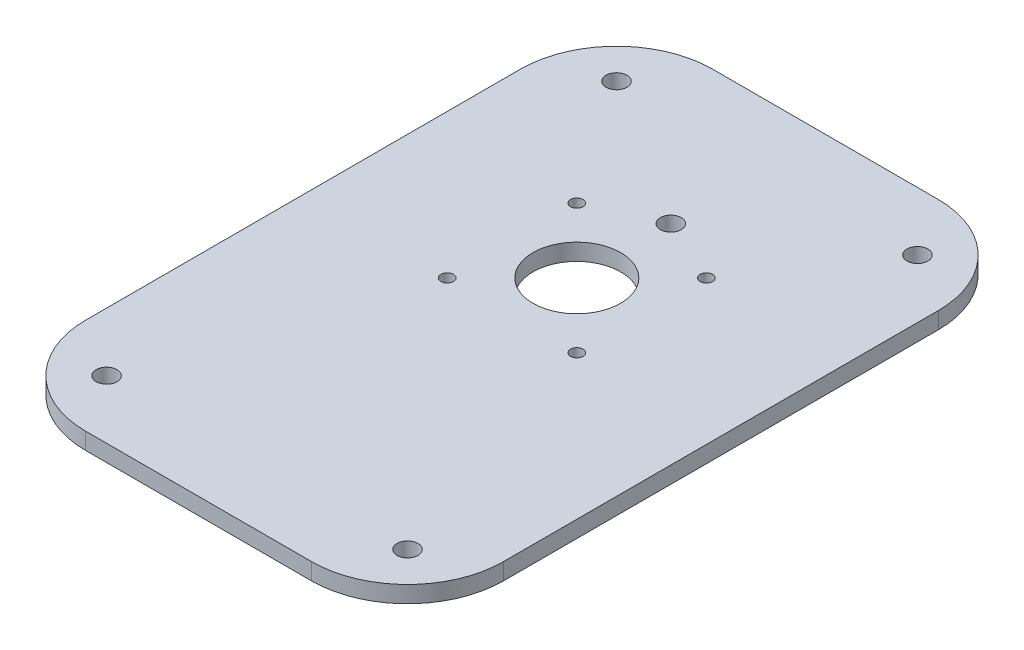
ISO-10303-21;
HEADER;
FILE_DESCRIPTION(('STEP AP214'),'2;1');
FILE_NAME('part.step','',(''),(''),'','','');
FILE_SCHEMA(('AUTOMOTIVE_DESIGN { 1 0 10303 214 1 1 1 1 }'));
ENDSEC;
DATA;
#1=APPLICATION_CONTEXT('core data for automotive mechanical design processes');
#2=APPLICATION_PROTOCOL_DEFINITION('international standard','automotive_design',2000,#1);
#3=PRODUCT_CONTEXT('',#1,'mechanical');
#4=PRODUCT('Part','Part','',(#3));
#5=PRODUCT_RELATED_PRODUCT_CATEGORY('part','',(#4));
#6=PRODUCT_DEFINITION_FORMATION('','',#4);
#7=PRODUCT_DEFINITION_CONTEXT('part definition',#1,'design');
#8=PRODUCT_DEFINITION('design','',#6,#7);
#9=PRODUCT_DEFINITION_SHAPE('','',#8);
#10=(LENGTH_UNIT() NAMED_UNIT(*) SI_UNIT(.MILLI.,.METRE.));
#11=(NAMED_UNIT(*) PLANE_ANGLE_UNIT() SI_UNIT($,.RADIAN.));
#12=(NAMED_UNIT(*) SI_UNIT($,.STERADIAN.) SOLID_ANGLE_UNIT());
#13=UNCERTAINTY_MEASURE_WITH_UNIT(LENGTH_MEASURE(1.E-05),#10,'distance_accuracy_value','');
#14=(GEOMETRIC_REPRESENTATION_CONTEXT(3) GLOBAL_UNCERTAINTY_ASSIGNED_CONTEXT((#13)) GLOBAL_UNIT_ASSIGNED_CONTEXT((#10,
#11,#12)) REPRESENTATION_CONTEXT('',''));
#15=CARTESIAN_POINT('',(0.,0.,0.));
#16=DIRECTION('',(0.,0.,1.));
#17=DIRECTION('',(1.,0.,0.));
#18=AXIS2_PLACEMENT_3D('',#15,#16,#17);
#19=CARTESIAN_POINT('',(-27.,4.,52.));
#20=DIRECTION('',(0.,-1.,0.));
#21=DIRECTION('',(0.,0.,-1.));
#22=AXIS2_PLACEMENT_3D('',#19,#20,#21);
#23=PLANE('',#22);
#24=CARTESIAN_POINT('',(-27.,4.,52.));
#25=DIRECTION('',(0.,1.,0.));
#26=DIRECTION('',(0.,0.,-1.));
#27=AXIS2_PLACEMENT_3D('',#24,#25,#26);
#28=CIRCLE('',#27,23.);
#29=CARTESIAN_POINT('',(-50.,4.,52.));
#30=VERTEX_POINT('',#29);
#31=CARTESIAN_POINT('',(-27.,4.,75.));
#32=VERTEX_POINT('',#31);
#33=EDGE_CURVE('E145',#30,#32,#28,.T.);
#34=ORIENTED_EDGE('',*,*,#33,.T.);
#35=DIRECTION('',(1.,0.,0.));
#36=VECTOR('',#35,1.);
#37=CARTESIAN_POINT('',(-27.,4.,75.));
#38=LINE('',#37,#36);
#39=CARTESIAN_POINT('',(27.,4.,75.));
#40=VERTEX_POINT('',#39);
#41=EDGE_CURVE('E93',#32,#40,#38,.T.);
#42=ORIENTED_EDGE('',*,*,#41,.T.);
#43=CARTESIAN_POINT('',(27.,4.,52.));
#44=DIRECTION('',(0.,1.,0.));
#45=DIRECTION('',(0.,0.,1.));
#46=AXIS2_PLACEMENT_3D('',#43,#44,#45);
#47=CIRCLE('',#46,23.);
#48=CARTESIAN_POINT('',(50.,4.,52.));
#49=VERTEX_POINT('',#48);
#50=EDGE_CURVE('E160',#40,#49,#47,.T.);
#51=ORIENTED_EDGE('',*,*,#50,.T.);
#52=DIRECTION('',(0.,0.,-1.));
#53=VECTOR('',#52,1.);
#54=CARTESIAN_POINT('',(50.,4.,52.));
#55=LINE('',#54,#53);
#56=CARTESIAN_POINT('',(50.,4.,-52.));
#57=VERTEX_POINT('',#56);
#58=EDGE_CURVE('E173',#49,#57,#55,.T.);
#59=ORIENTED_EDGE('',*,*,#58,.T.);
#60=CARTESIAN_POINT('',(27.,4.,-52.));
#61=DIRECTION('',(0.,1.,0.));
#62=DIRECTION('',(0.,0.,-1.));
#63=AXIS2_PLACEMENT_3D('',#60,#61,#62);
#64=CIRCLE('',#63,23.);
#65=CARTESIAN_POINT('',(27.,4.,-75.));
#66=VERTEX_POINT('',#65);
#67=EDGE_CURVE('E112',#57,#66,#64,.T.);
#68=ORIENTED_EDGE('',*,*,#67,.T.);
#69=DIRECTION('',(-1.,0.,0.));
#70=VECTOR('',#69,1.);
#71=CARTESIAN_POINT('',(-27.,4.,-75.));
#72=LINE('',#71,#70);
#73=CARTESIAN_POINT('',(-27.,4.,-75.));
#74=VERTEX_POINT('',#73);
#75=EDGE_CURVE('E106',#66,#74,#72,.T.);
#76=ORIENTED_EDGE('',*,*,#75,.T.);
#77=CARTESIAN_POINT('',(-27.,4.,-52.));
#78=DIRECTION('',(0.,1.,0.));
#79=DIRECTION('',(0.,0.,-1.));
#80=AXIS2_PLACEMENT_3D('',#77,#78,#79);
#81=CIRCLE('',#80,23.);
#82=CARTESIAN_POINT('',(-50.,4.,-52.));
#83=VERTEX_POINT('',#82);
#84=EDGE_CURVE('E110',#74,#83,#81,.T.);
#85=ORIENTED_EDGE('',*,*,#84,.T.);
#86=DIRECTION('',(0.,0.,1.));
#87=VECTOR('',#86,1.);
#88=CARTESIAN_POINT('',(-50.,4.,52.));
#89=LINE('',#88,#87);
#90=EDGE_CURVE('E50',#83,#30,#89,.T.);
#91=ORIENTED_EDGE('',*,*,#90,.T.);
#92=EDGE_LOOP('',(#34,#42,#51,#59,#68,#76,#85,#91));
#93=FACE_BOUND('',#92,.T.);
#94=CARTESIAN_POINT('',(-36.,4.,-61.));
#95=DIRECTION('',(0.,1.,0.));
#96=DIRECTION('',(0.,0.,1.));
#97=AXIS2_PLACEMENT_3D('',#94,#95,#96);
#98=CIRCLE('',#97,2.5);
#99=CARTESIAN_POINT('',(-36.,4.,-58.5));
#100=VERTEX_POINT('',#99);
#101=EDGE_CURVE('E134',#100,#100,#98,.T.);
#102=ORIENTED_EDGE('',*,*,#101,.F.);
#103=EDGE_LOOP('',(#102));
#104=FACE_BOUND('',#103,.T.);
#105=CARTESIAN_POINT('',(-36.,4.,61.));
#106=DIRECTION('',(0.,1.,0.));
#107=DIRECTION('',(0.,0.,1.));
#108=AXIS2_PLACEMENT_3D('',#105,#106,#107);
#109=CIRCLE('',#108,2.5);
#110=CARTESIAN_POINT('',(-36.,4.,63.5));
#111=VERTEX_POINT('',#110);
#112=EDGE_CURVE('E182',#111,#111,#109,.T.);
#113=ORIENTED_EDGE('',*,*,#112,.F.);
#114=EDGE_LOOP('',(#113));
#115=FACE_BOUND('',#114,.T.);
#116=CARTESIAN_POINT('',(0.,4.,-15.5));
#117=DIRECTION('',(0.,1.,0.));
#118=DIRECTION('',(0.,0.,1.));
#119=AXIS2_PLACEMENT_3D('',#116,#117,#118);
#120=CIRCLE('',#119,10.5);
#121=CARTESIAN_POINT('',(0.,4.,-4.99999999999999));
#122=VERTEX_POINT('',#121);
#123=EDGE_CURVE('E188',#122,#122,#120,.T.);
#124=ORIENTED_EDGE('',*,*,#123,.F.);
#125=EDGE_LOOP('',(#124));
#126=FACE_BOUND('',#125,.T.);
#127=CARTESIAN_POINT('',(36.,4.,61.));
#128=DIRECTION('',(0.,1.,0.));
#129=DIRECTION('',(0.,0.,-1.));
#130=AXIS2_PLACEMENT_3D('',#127,#128,#129);
#131=CIRCLE('',#130,2.5);
#132=CARTESIAN_POINT('',(36.,4.,58.5));
#133=VERTEX_POINT('',#132);
#134=EDGE_CURVE('E194',#133,#133,#131,.T.);
#135=ORIENTED_EDGE('',*,*,#134,.F.);
#136=EDGE_LOOP('',(#135));
#137=FACE_BOUND('',#136,.T.);
#138=CARTESIAN_POINT('',(36.,4.,-61.));
#139=DIRECTION('',(0.,1.,0.));
#140=DIRECTION('',(0.,0.,-1.));
#141=AXIS2_PLACEMENT_3D('',#138,#139,#140);
#142=CIRCLE('',#141,2.5);
#143=CARTESIAN_POINT('',(36.,4.,-63.5));
#144=VERTEX_POINT('',#143);
#145=EDGE_CURVE('E200',#144,#144,#142,.T.);
#146=ORIENTED_EDGE('',*,*,#145,.F.);
#147=EDGE_LOOP('',(#146));
#148=FACE_BOUND('',#147,.T.);
#149=CARTESIAN_POINT('',(0.,4.,-38.));
#150=DIRECTION('',(0.,1.,0.));
#151=DIRECTION('',(0.,0.,1.));
#152=AXIS2_PLACEMENT_3D('',#149,#150,#151);
#153=CIRCLE('',#152,2.5);
#154=CARTESIAN_POINT('',(0.,4.,-35.5));
#155=VERTEX_POINT('',#154);
#156=EDGE_CURVE('E206',#155,#155,#153,.T.);
#157=ORIENTED_EDGE('',*,*,#156,.F.);
#158=EDGE_LOOP('',(#157));
#159=FACE_BOUND('',#158,.T.);
#160=CARTESIAN_POINT('',(15.5,4.,-31.));
#161=DIRECTION('',(0.,1.,0.));
#162=DIRECTION('',(0.,0.,1.));
#163=AXIS2_PLACEMENT_3D('',#160,#161,#162);
#164=CIRCLE('',#163,1.5);
#165=CARTESIAN_POINT('',(15.5,4.,-29.5));
#166=VERTEX_POINT('',#165);
#167=EDGE_CURVE('E212',#166,#166,#164,.T.);
#168=ORIENTED_EDGE('',*,*,#167,.F.);
#169=EDGE_LOOP('',(#168));
#170=FACE_BOUND('',#169,.T.);
#171=CARTESIAN_POINT('',(-15.5,4.,-31.));
#172=DIRECTION('',(0.,1.,0.));
#173=DIRECTION('',(0.,0.,1.));
#174=AXIS2_PLACEMENT_3D('',#171,#172,#173);
#175=CIRCLE('',#174,1.5);
#176=CARTESIAN_POINT('',(-15.5,4.,-29.5));
#177=VERTEX_POINT('',#176);
#178=EDGE_CURVE('E218',#177,#177,#175,.T.);
#179=ORIENTED_EDGE('',*,*,#178,.F.);
#180=EDGE_LOOP('',(#179));
#181=FACE_BOUND('',#180,.T.);
#182=CARTESIAN_POINT('',(-15.5,4.,0.));
#183=DIRECTION('',(0.,1.,0.));
#184=DIRECTION('',(0.,0.,1.));
#185=AXIS2_PLACEMENT_3D('',#182,#183,#184);
#186=CIRCLE('',#185,1.5);
#187=CARTESIAN_POINT('',(-15.5,4.,1.50000000000001));
#188=VERTEX_POINT('',#187);
#189=EDGE_CURVE('E224',#188,#188,#186,.T.);
#190=ORIENTED_EDGE('',*,*,#189,.F.);
#191=EDGE_LOOP('',(#190));
#192=FACE_BOUND('',#191,.T.);
#193=CARTESIAN_POINT('',(15.5,4.,0.));
#194=DIRECTION('',(0.,1.,0.));
#195=DIRECTION('',(0.,0.,1.));
#196=AXIS2_PLACEMENT_3D('',#193,#194,#195);
#197=CIRCLE('',#196,1.5);
#198=CARTESIAN_POINT('',(15.5,4.,1.50000000000001));
#199=VERTEX_POINT('',#198);
#200=EDGE_CURVE('E230',#199,#199,#197,.T.);
#201=ORIENTED_EDGE('',*,*,#200,.F.);
#202=EDGE_LOOP('',(#201));
#203=FACE_BOUND('',#202,.T.);
#204=ADVANCED_FACE('F33',(#93,#104,#115,#126,#137,#148,#159,#170,#181,#192,#203),#23,.F.);
#205=CARTESIAN_POINT('',(-27.,0.,52.));
#206=DIRECTION('',(0.,-1.,0.));
#207=DIRECTION('',(0.,0.,-1.));
#208=AXIS2_PLACEMENT_3D('',#205,#206,#207);
#209=PLANE('',#208);
#210=CARTESIAN_POINT('',(-15.5,0.,0.));
#211=DIRECTION('',(0.,1.,0.));
#212=DIRECTION('',(0.,0.,1.));
#213=AXIS2_PLACEMENT_3D('',#210,#211,#212);
#214=CIRCLE('',#213,1.5);
#215=CARTESIAN_POINT('',(-15.5,0.,1.50000000000001));
#216=VERTEX_POINT('',#215);
#217=EDGE_CURVE('E227',#216,#216,#214,.T.);
#218=ORIENTED_EDGE('',*,*,#217,.T.);
#219=EDGE_LOOP('',(#218));
#220=FACE_BOUND('',#219,.T.);
#221=CARTESIAN_POINT('',(15.5,0.,-31.));
#222=DIRECTION('',(0.,1.,0.));
#223=DIRECTION('',(0.,0.,1.));
#224=AXIS2_PLACEMENT_3D('',#221,#222,#223);
#225=CIRCLE('',#224,1.5);
#226=CARTESIAN_POINT('',(15.5,0.,-29.5));
#227=VERTEX_POINT('',#226);
#228=EDGE_CURVE('E215',#227,#227,#225,.T.);
#229=ORIENTED_EDGE('',*,*,#228,.T.);
#230=EDGE_LOOP('',(#229));
#231=FACE_BOUND('',#230,.T.);
#232=CARTESIAN_POINT('',(36.,0.,-61.));
#233=DIRECTION('',(0.,1.,0.));
#234=DIRECTION('',(0.,0.,-1.));
#235=AXIS2_PLACEMENT_3D('',#232,#233,#234);
#236=CIRCLE('',#235,2.5);
#237=CARTESIAN_POINT('',(36.,0.,-63.5));
#238=VERTEX_POINT('',#237);
#239=EDGE_CURVE('E203',#238,#238,#236,.T.);
#240=ORIENTED_EDGE('',*,*,#239,.T.);
#241=EDGE_LOOP('',(#240));
#242=FACE_BOUND('',#241,.T.);
#243=CARTESIAN_POINT('',(0.,0.,-15.5));
#244=DIRECTION('',(0.,1.,0.));
#245=DIRECTION('',(0.,0.,1.));
#246=AXIS2_PLACEMENT_3D('',#243,#244,#245);
#247=CIRCLE('',#246,10.5);
#248=CARTESIAN_POINT('',(0.,0.,-4.99999999999999));
#249=VERTEX_POINT('',#248);
#250=EDGE_CURVE('E191',#249,#249,#247,.T.);
#251=ORIENTED_EDGE('',*,*,#250,.T.);
#252=EDGE_LOOP('',(#251));
#253=FACE_BOUND('',#252,.T.);
#254=CARTESIAN_POINT('',(-36.,0.,-61.));
#255=DIRECTION('',(0.,1.,0.));
#256=DIRECTION('',(0.,0.,1.));
#257=AXIS2_PLACEMENT_3D('',#254,#255,#256);
#258=CIRCLE('',#257,2.5);
#259=CARTESIAN_POINT('',(-36.,0.,-58.5));
#260=VERTEX_POINT('',#259);
#261=EDGE_CURVE('E179',#260,#260,#258,.T.);
#262=ORIENTED_EDGE('',*,*,#261,.T.);
#263=EDGE_LOOP('',(#262));
#264=FACE_BOUND('',#263,.T.);
#265=CARTESIAN_POINT('',(-27.,0.,52.));
#266=DIRECTION('',(0.,1.,0.));
#267=DIRECTION('',(0.,0.,-1.));
#268=AXIS2_PLACEMENT_3D('',#265,#266,#267);
#269=CIRCLE('',#268,23.);
#270=CARTESIAN_POINT('',(-50.,0.,52.));
#271=VERTEX_POINT('',#270);
#272=CARTESIAN_POINT('',(-27.,0.,75.));
#273=VERTEX_POINT('',#272);
#274=EDGE_CURVE('E130',#271,#273,#269,.T.);
#275=ORIENTED_EDGE('',*,*,#274,.F.);
#276=DIRECTION('',(0.,0.,1.));
#277=VECTOR('',#276,1.);
#278=CARTESIAN_POINT('',(-50.,0.,52.));
#279=LINE('',#278,#277);
#280=CARTESIAN_POINT('',(-50.,0.,-52.));
#281=VERTEX_POINT('',#280);
#282=EDGE_CURVE('E85',#281,#271,#279,.T.);
#283=ORIENTED_EDGE('',*,*,#282,.F.);
#284=CARTESIAN_POINT('',(-27.,0.,-52.));
#285=DIRECTION('',(0.,1.,0.));
#286=DIRECTION('',(0.,0.,-1.));
#287=AXIS2_PLACEMENT_3D('',#284,#285,#286);
#288=CIRCLE('',#287,23.);
#289=CARTESIAN_POINT('',(-27.,0.,-75.));
#290=VERTEX_POINT('',#289);
#291=EDGE_CURVE('E79',#290,#281,#288,.T.);
#292=ORIENTED_EDGE('',*,*,#291,.F.);
#293=DIRECTION('',(-1.,0.,0.));
#294=VECTOR('',#293,1.);
#295=CARTESIAN_POINT('',(-27.,0.,-75.));
#296=LINE('',#295,#294);
#297=CARTESIAN_POINT('',(27.,0.,-75.));
#298=VERTEX_POINT('',#297);
#299=EDGE_CURVE('E120',#298,#290,#296,.T.);
#300=ORIENTED_EDGE('',*,*,#299,.F.);
#301=CARTESIAN_POINT('',(27.,0.,-52.));
#302=DIRECTION('',(0.,1.,0.));
#303=DIRECTION('',(0.,0.,-1.));
#304=AXIS2_PLACEMENT_3D('',#301,#302,#303);
#305=CIRCLE('',#304,23.);
#306=CARTESIAN_POINT('',(50.,0.,-52.));
#307=VERTEX_POINT('',#306);
#308=EDGE_CURVE('E140',#307,#298,#305,.T.);
#309=ORIENTED_EDGE('',*,*,#308,.F.);
#310=DIRECTION('',(0.,0.,-1.));
#311=VECTOR('',#310,1.);
#312=CARTESIAN_POINT('',(50.,0.,52.));
#313=LINE('',#312,#311);
#314=CARTESIAN_POINT('',(50.,0.,52.));
#315=VERTEX_POINT('',#314);
#316=EDGE_CURVE('E138',#315,#307,#313,.T.);
#317=ORIENTED_EDGE('',*,*,#316,.F.);
#318=CARTESIAN_POINT('',(27.,0.,52.));
#319=DIRECTION('',(0.,1.,0.));
#320=DIRECTION('',(0.,0.,1.));
#321=AXIS2_PLACEMENT_3D('',#318,#319,#320);
#322=CIRCLE('',#321,23.);
#323=CARTESIAN_POINT('',(27.,0.,75.));
#324=VERTEX_POINT('',#323);
#325=EDGE_CURVE('E136',#324,#315,#322,.T.);
#326=ORIENTED_EDGE('',*,*,#325,.F.);
#327=DIRECTION('',(1.,0.,0.));
#328=VECTOR('',#327,1.);
#329=CARTESIAN_POINT('',(-27.,0.,75.));
#330=LINE('',#329,#328);
#331=EDGE_CURVE('E133',#273,#324,#330,.T.);
#332=ORIENTED_EDGE('',*,*,#331,.F.);
#333=EDGE_LOOP('',(#275,#283,#292,#300,#309,#317,#326,#332));
#334=FACE_BOUND('',#333,.T.);
#335=CARTESIAN_POINT('',(-36.,0.,61.));
#336=DIRECTION('',(0.,1.,0.));
#337=DIRECTION('',(0.,0.,1.));
#338=AXIS2_PLACEMENT_3D('',#335,#336,#337);
#339=CIRCLE('',#338,2.5);
#340=CARTESIAN_POINT('',(-36.,0.,63.5));
#341=VERTEX_POINT('',#340);
#342=EDGE_CURVE('E185',#341,#341,#339,.T.);
#343=ORIENTED_EDGE('',*,*,#342,.T.);
#344=EDGE_LOOP('',(#343));
#345=FACE_BOUND('',#344,.T.);
#346=CARTESIAN_POINT('',(36.,0.,61.));
#347=DIRECTION('',(0.,1.,0.));
#348=DIRECTION('',(0.,0.,-1.));
#349=AXIS2_PLACEMENT_3D('',#346,#347,#348);
#350=CIRCLE('',#349,2.5);
#351=CARTESIAN_POINT('',(36.,0.,58.5));
#352=VERTEX_POINT('',#351);
#353=EDGE_CURVE('E197',#352,#352,#350,.T.);
#354=ORIENTED_EDGE('',*,*,#353,.T.);
#355=EDGE_LOOP('',(#354));
#356=FACE_BOUND('',#355,.T.);
#357=CARTESIAN_POINT('',(0.,0.,-38.));
#358=DIRECTION('',(0.,1.,0.));
#359=DIRECTION('',(0.,0.,1.));
#360=AXIS2_PLACEMENT_3D('',#357,#358,#359);
#361=CIRCLE('',#360,2.5);
#362=CARTESIAN_POINT('',(0.,0.,-35.5));
#363=VERTEX_POINT('',#362);
#364=EDGE_CURVE('E209',#363,#363,#361,.T.);
#365=ORIENTED_EDGE('',*,*,#364,.T.);
#366=EDGE_LOOP('',(#365));
#367=FACE_BOUND('',#366,.T.);
#368=CARTESIAN_POINT('',(-15.5,0.,-31.));
#369=DIRECTION('',(0.,1.,0.));
#370=DIRECTION('',(0.,0.,1.));
#371=AXIS2_PLACEMENT_3D('',#368,#369,#370);
#372=CIRCLE('',#371,1.5);
#373=CARTESIAN_POINT('',(-15.5,0.,-29.5));
#374=VERTEX_POINT('',#373);
#375=EDGE_CURVE('E221',#374,#374,#372,.T.);
#376=ORIENTED_EDGE('',*,*,#375,.T.);
#377=EDGE_LOOP('',(#376));
#378=FACE_BOUND('',#377,.T.);
#379=CARTESIAN_POINT('',(15.5,0.,0.));
#380=DIRECTION('',(0.,1.,0.));
#381=DIRECTION('',(0.,0.,1.));
#382=AXIS2_PLACEMENT_3D('',#379,#380,#381);
#383=CIRCLE('',#382,1.5);
#384=CARTESIAN_POINT('',(15.5,0.,1.50000000000001));
#385=VERTEX_POINT('',#384);
#386=EDGE_CURVE('E233',#385,#385,#383,.T.);
#387=ORIENTED_EDGE('',*,*,#386,.T.);
#388=EDGE_LOOP('',(#387));
#389=FACE_BOUND('',#388,.T.);
#390=ADVANCED_FACE('F164',(#220,#231,#242,#253,#264,#334,#345,#356,#367,#378,#389),#209,.T.);
#391=CARTESIAN_POINT('',(-27.,4.,52.));
#392=DIRECTION('',(0.,-1.,0.));
#393=DIRECTION('',(0.,0.,-1.));
#394=AXIS2_PLACEMENT_3D('',#391,#392,#393);
#395=CYLINDRICAL_SURFACE('',#394,23.);
#396=ORIENTED_EDGE('',*,*,#274,.T.);
#397=DIRECTION('',(0.,-1.,0.));
#398=VECTOR('',#397,1.);
#399=CARTESIAN_POINT('',(-27.,4.,75.));
#400=LINE('',#399,#398);
#401=EDGE_CURVE('E11',#32,#273,#400,.T.);
#402=ORIENTED_EDGE('',*,*,#401,.F.);
#403=ORIENTED_EDGE('',*,*,#33,.F.);
#404=DIRECTION('',(0.,-1.,0.));
#405=VECTOR('',#404,1.);
#406=CARTESIAN_POINT('',(-50.,4.,52.));
#407=LINE('',#406,#405);
#408=EDGE_CURVE('E126',#30,#271,#407,.T.);
#409=ORIENTED_EDGE('',*,*,#408,.T.);
#410=EDGE_LOOP('',(#396,#402,#403,#409));
#411=FACE_BOUND('',#410,.T.);
#412=ADVANCED_FACE('F35',(#411),#395,.T.);
#413=CARTESIAN_POINT('',(-27.,4.,75.));
#414=DIRECTION('',(0.,0.,-1.));
#415=DIRECTION('',(-1.,0.,0.));
#416=AXIS2_PLACEMENT_3D('',#413,#414,#415);
#417=PLANE('',#416);
#418=ORIENTED_EDGE('',*,*,#331,.T.);
#419=DIRECTION('',(0.,-1.,0.));
#420=VECTOR('',#419,1.);
#421=CARTESIAN_POINT('',(27.,4.,75.));
#422=LINE('',#421,#420);
#423=EDGE_CURVE('E42',#40,#324,#422,.T.);
#424=ORIENTED_EDGE('',*,*,#423,.F.);
#425=ORIENTED_EDGE('',*,*,#41,.F.);
#426=ORIENTED_EDGE('',*,*,#401,.T.);
#427=EDGE_LOOP('',(#418,#424,#425,#426));
#428=FACE_BOUND('',#427,.T.);
#429=ADVANCED_FACE('F265',(#428),#417,.F.);
#430=CARTESIAN_POINT('',(27.,4.,52.));
#431=DIRECTION('',(0.,-1.,0.));
#432=DIRECTION('',(0.,0.,-1.));
#433=AXIS2_PLACEMENT_3D('',#430,#431,#432);
#434=CYLINDRICAL_SURFACE('',#433,23.);
#435=ORIENTED_EDGE('',*,*,#325,.T.);
#436=DIRECTION('',(0.,-1.,0.));
#437=VECTOR('',#436,1.);
#438=CARTESIAN_POINT('',(50.,4.,52.));
#439=LINE('',#438,#437);
#440=EDGE_CURVE('E152',#49,#315,#439,.T.);
#441=ORIENTED_EDGE('',*,*,#440,.F.);
#442=ORIENTED_EDGE('',*,*,#50,.F.);
#443=ORIENTED_EDGE('',*,*,#423,.T.);
#444=EDGE_LOOP('',(#435,#441,#442,#443));
#445=FACE_BOUND('',#444,.T.);
#446=ADVANCED_FACE('F158',(#445),#434,.T.);
#447=CARTESIAN_POINT('',(50.,4.,52.));
#448=DIRECTION('',(-1.,0.,0.));
#449=DIRECTION('',(0.,0.,1.));
#450=AXIS2_PLACEMENT_3D('',#447,#448,#449);
#451=PLANE('',#450);
#452=ORIENTED_EDGE('',*,*,#316,.T.);
#453=DIRECTION('',(0.,-1.,0.));
#454=VECTOR('',#453,1.);
#455=CARTESIAN_POINT('',(50.,4.,-52.));
#456=LINE('',#455,#454);
#457=EDGE_CURVE('E149',#57,#307,#456,.T.);
#458=ORIENTED_EDGE('',*,*,#457,.F.);
#459=ORIENTED_EDGE('',*,*,#58,.F.);
#460=ORIENTED_EDGE('',*,*,#440,.T.);
#461=EDGE_LOOP('',(#452,#458,#459,#460));
#462=FACE_BOUND('',#461,.T.);
#463=ADVANCED_FACE('F169',(#462),#451,.F.);
#464=CARTESIAN_POINT('',(27.,4.,-52.));
#465=DIRECTION('',(0.,-1.,0.));
#466=DIRECTION('',(0.,0.,-1.));
#467=AXIS2_PLACEMENT_3D('',#464,#465,#466);
#468=CYLINDRICAL_SURFACE('',#467,23.);
#469=ORIENTED_EDGE('',*,*,#308,.T.);
#470=DIRECTION('',(0.,-1.,0.));
#471=VECTOR('',#470,1.);
#472=CARTESIAN_POINT('',(27.,4.,-75.));
#473=LINE('',#472,#471);
#474=EDGE_CURVE('E121',#66,#298,#473,.T.);
#475=ORIENTED_EDGE('',*,*,#474,.F.);
#476=ORIENTED_EDGE('',*,*,#67,.F.);
#477=ORIENTED_EDGE('',*,*,#457,.T.);
#478=EDGE_LOOP('',(#469,#475,#476,#477));
#479=FACE_BOUND('',#478,.T.);
#480=ADVANCED_FACE('F172',(#479),#468,.T.);
#481=CARTESIAN_POINT('',(-27.,4.,-75.));
#482=DIRECTION('',(0.,0.,1.));
#483=DIRECTION('',(1.,0.,0.));
#484=AXIS2_PLACEMENT_3D('',#481,#482,#483);
#485=PLANE('',#484);
#486=ORIENTED_EDGE('',*,*,#299,.T.);
#487=DIRECTION('',(0.,-1.,0.));
#488=VECTOR('',#487,1.);
#489=CARTESIAN_POINT('',(-27.,4.,-75.));
#490=LINE('',#489,#488);
#491=EDGE_CURVE('E117',#74,#290,#490,.T.);
#492=ORIENTED_EDGE('',*,*,#491,.F.);
#493=ORIENTED_EDGE('',*,*,#75,.F.);
#494=ORIENTED_EDGE('',*,*,#474,.T.);
#495=EDGE_LOOP('',(#486,#492,#493,#494));
#496=FACE_BOUND('',#495,.T.);
#497=ADVANCED_FACE('F118',(#496),#485,.F.);
#498=CARTESIAN_POINT('',(-27.,4.,-52.));
#499=DIRECTION('',(0.,-1.,0.));
#500=DIRECTION('',(0.,0.,-1.));
#501=AXIS2_PLACEMENT_3D('',#498,#499,#500);
#502=CYLINDRICAL_SURFACE('',#501,23.);
#503=ORIENTED_EDGE('',*,*,#291,.T.);
#504=DIRECTION('',(0.,-1.,0.));
#505=VECTOR('',#504,1.);
#506=CARTESIAN_POINT('',(-50.,4.,-52.));
#507=LINE('',#506,#505);
#508=EDGE_CURVE('E122',#83,#281,#507,.T.);
#509=ORIENTED_EDGE('',*,*,#508,.F.);
#510=ORIENTED_EDGE('',*,*,#84,.F.);
#511=ORIENTED_EDGE('',*,*,#491,.T.);
#512=EDGE_LOOP('',(#503,#509,#510,#511));
#513=FACE_BOUND('',#512,.T.);
#514=ADVANCED_FACE('F124',(#513),#502,.T.);
#515=CARTESIAN_POINT('',(-50.,4.,52.));
#516=DIRECTION('',(1.,0.,0.));
#517=DIRECTION('',(0.,0.,-1.));
#518=AXIS2_PLACEMENT_3D('',#515,#516,#517);
#519=PLANE('',#518);
#520=ORIENTED_EDGE('',*,*,#282,.T.);
#521=ORIENTED_EDGE('',*,*,#408,.F.);
#522=ORIENTED_EDGE('',*,*,#90,.F.);
#523=ORIENTED_EDGE('',*,*,#508,.T.);
#524=EDGE_LOOP('',(#520,#521,#522,#523));
#525=FACE_BOUND('',#524,.T.);
#526=ADVANCED_FACE('F253',(#525),#519,.F.);
#527=CARTESIAN_POINT('',(-36.,4.,-61.));
#528=DIRECTION('',(0.,-1.,0.));
#529=DIRECTION('',(0.,0.,-1.));
#530=AXIS2_PLACEMENT_3D('',#527,#528,#529);
#531=CYLINDRICAL_SURFACE('',#530,2.5);
#532=ORIENTED_EDGE('',*,*,#101,.T.);
#533=EDGE_LOOP('',(#532));
#534=FACE_BOUND('',#533,.T.);
#535=ORIENTED_EDGE('',*,*,#261,.F.);
#536=EDGE_LOOP('',(#535));
#537=FACE_BOUND('',#536,.T.);
#538=ADVANCED_FACE('F250',(#534,#537),#531,.F.);
#539=CARTESIAN_POINT('',(-36.,4.,61.));
#540=DIRECTION('',(0.,-1.,0.));
#541=DIRECTION('',(0.,0.,-1.));
#542=AXIS2_PLACEMENT_3D('',#539,#540,#541);
#543=CYLINDRICAL_SURFACE('',#542,2.5);
#544=ORIENTED_EDGE('',*,*,#112,.T.);
#545=EDGE_LOOP('',(#544));
#546=FACE_BOUND('',#545,.T.);
#547=ORIENTED_EDGE('',*,*,#342,.F.);
#548=EDGE_LOOP('',(#547));
#549=FACE_BOUND('',#548,.T.);
#550=ADVANCED_FACE('F329',(#546,#549),#543,.F.);
#551=CARTESIAN_POINT('',(0.,4.,-15.5));
#552=DIRECTION('',(0.,-1.,0.));
#553=DIRECTION('',(0.,0.,-1.));
#554=AXIS2_PLACEMENT_3D('',#551,#552,#553);
#555=CYLINDRICAL_SURFACE('',#554,10.5);
#556=ORIENTED_EDGE('',*,*,#123,.T.);
#557=EDGE_LOOP('',(#556));
#558=FACE_BOUND('',#557,.T.);
#559=ORIENTED_EDGE('',*,*,#250,.F.);
#560=EDGE_LOOP('',(#559));
#561=FACE_BOUND('',#560,.T.);
#562=ADVANCED_FACE('F337',(#558,#561),#555,.F.);
#563=CARTESIAN_POINT('',(36.,4.,61.));
#564=DIRECTION('',(0.,-1.,0.));
#565=DIRECTION('',(0.,0.,-1.));
#566=AXIS2_PLACEMENT_3D('',#563,#564,#565);
#567=CYLINDRICAL_SURFACE('',#566,2.5);
#568=ORIENTED_EDGE('',*,*,#134,.T.);
#569=EDGE_LOOP('',(#568));
#570=FACE_BOUND('',#569,.T.);
#571=ORIENTED_EDGE('',*,*,#353,.F.);
#572=EDGE_LOOP('',(#571));
#573=FACE_BOUND('',#572,.T.);
#574=ADVANCED_FACE('F345',(#570,#573),#567,.F.);
#575=CARTESIAN_POINT('',(36.,4.,-61.));
#576=DIRECTION('',(0.,-1.,0.));
#577=DIRECTION('',(0.,0.,-1.));
#578=AXIS2_PLACEMENT_3D('',#575,#576,#577);
#579=CYLINDRICAL_SURFACE('',#578,2.5);
#580=ORIENTED_EDGE('',*,*,#145,.T.);
#581=EDGE_LOOP('',(#580));
#582=FACE_BOUND('',#581,.T.);
#583=ORIENTED_EDGE('',*,*,#239,.F.);
#584=EDGE_LOOP('',(#583));
#585=FACE_BOUND('',#584,.T.);
#586=ADVANCED_FACE('F354',(#582,#585),#579,.F.);
#587=CARTESIAN_POINT('',(0.,4.,-38.));
#588=DIRECTION('',(0.,-1.,0.));
#589=DIRECTION('',(0.,0.,-1.));
#590=AXIS2_PLACEMENT_3D('',#587,#588,#589);
#591=CYLINDRICAL_SURFACE('',#590,2.5);
#592=ORIENTED_EDGE('',*,*,#156,.T.);
#593=EDGE_LOOP('',(#592));
#594=FACE_BOUND('',#593,.T.);
#595=ORIENTED_EDGE('',*,*,#364,.F.);
#596=EDGE_LOOP('',(#595));
#597=FACE_BOUND('',#596,.T.);
#598=ADVANCED_FACE('F363',(#594,#597),#591,.F.);
#599=CARTESIAN_POINT('',(15.5,4.,-31.));
#600=DIRECTION('',(0.,-1.,0.));
#601=DIRECTION('',(0.,0.,-1.));
#602=AXIS2_PLACEMENT_3D('',#599,#600,#601);
#603=CYLINDRICAL_SURFACE('',#602,1.5);
#604=ORIENTED_EDGE('',*,*,#167,.T.);
#605=EDGE_LOOP('',(#604));
#606=FACE_BOUND('',#605,.T.);
#607=ORIENTED_EDGE('',*,*,#228,.F.);
#608=EDGE_LOOP('',(#607));
#609=FACE_BOUND('',#608,.T.);
#610=ADVANCED_FACE('F372',(#606,#609),#603,.F.);
#611=CARTESIAN_POINT('',(-15.5,4.,-31.));
#612=DIRECTION('',(0.,-1.,0.));
#613=DIRECTION('',(0.,0.,-1.));
#614=AXIS2_PLACEMENT_3D('',#611,#612,#613);
#615=CYLINDRICAL_SURFACE('',#614,1.5);
#616=ORIENTED_EDGE('',*,*,#178,.T.);
#617=EDGE_LOOP('',(#616));
#618=FACE_BOUND('',#617,.T.);
#619=ORIENTED_EDGE('',*,*,#375,.F.);
#620=EDGE_LOOP('',(#619));
#621=FACE_BOUND('',#620,.T.);
#622=ADVANCED_FACE('F381',(#618,#621),#615,.F.);
#623=CARTESIAN_POINT('',(-15.5,4.,0.));
#624=DIRECTION('',(0.,-1.,0.));
#625=DIRECTION('',(0.,0.,-1.));
#626=AXIS2_PLACEMENT_3D('',#623,#624,#625);
#627=CYLINDRICAL_SURFACE('',#626,1.5);
#628=ORIENTED_EDGE('',*,*,#189,.T.);
#629=EDGE_LOOP('',(#628));
#630=FACE_BOUND('',#629,.T.);
#631=ORIENTED_EDGE('',*,*,#217,.F.);
#632=EDGE_LOOP('',(#631));
#633=FACE_BOUND('',#632,.T.);
#634=ADVANCED_FACE('F390',(#630,#633),#627,.F.);
#635=CARTESIAN_POINT('',(15.5,4.,0.));
#636=DIRECTION('',(0.,-1.,0.));
#637=DIRECTION('',(0.,0.,-1.));
#638=AXIS2_PLACEMENT_3D('',#635,#636,#637);
#639=CYLINDRICAL_SURFACE('',#638,1.5);
#640=ORIENTED_EDGE('',*,*,#200,.T.);
#641=EDGE_LOOP('',(#640));
#642=FACE_BOUND('',#641,.T.);
#643=ORIENTED_EDGE('',*,*,#386,.F.);
#644=EDGE_LOOP('',(#643));
#645=FACE_BOUND('',#644,.T.);
#646=ADVANCED_FACE('F239',(#642,#645),#639,.F.);
#647=CLOSED_SHELL('',(#204,#390,#412,#429,#446,#463,#480,#497,#514,#526,#538,#550,#562,#574,
#586,#598,#610,#622,#634,#646));
#648=MANIFOLD_SOLID_BREP('B2',#647);
#649=ADVANCED_BREP_SHAPE_REPRESENTATION('',(#18,#648),#14);
#650=SHAPE_DEFINITION_REPRESENTATION(#9,#649);
ENDSEC;
END-ISO-10303-21;
